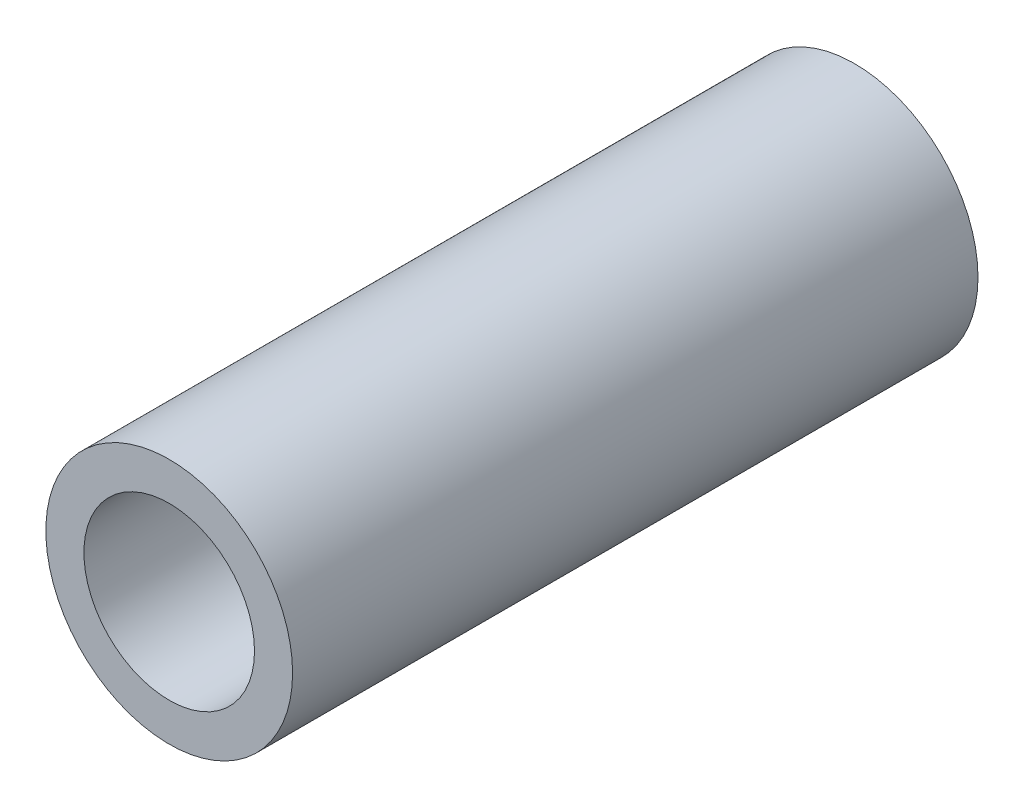
ISO-10303-21;
HEADER;
FILE_DESCRIPTION(('STEP AP214'),'2;1');
FILE_NAME('part.step','',(''),(''),'','','');
FILE_SCHEMA(('AUTOMOTIVE_DESIGN { 1 0 10303 214 1 1 1 1 }'));
ENDSEC;
DATA;
#1=APPLICATION_CONTEXT('core data for automotive mechanical design processes');
#2=APPLICATION_PROTOCOL_DEFINITION('international standard','automotive_design',2000,#1);
#3=PRODUCT_CONTEXT('',#1,'mechanical');
#4=PRODUCT('Part','Part','',(#3));
#5=PRODUCT_RELATED_PRODUCT_CATEGORY('part','',(#4));
#6=PRODUCT_DEFINITION_FORMATION('','',#4);
#7=PRODUCT_DEFINITION_CONTEXT('part definition',#1,'design');
#8=PRODUCT_DEFINITION('design','',#6,#7);
#9=PRODUCT_DEFINITION_SHAPE('','',#8);
#10=(LENGTH_UNIT() NAMED_UNIT(*) SI_UNIT(.MILLI.,.METRE.));
#11=(NAMED_UNIT(*) PLANE_ANGLE_UNIT() SI_UNIT($,.RADIAN.));
#12=(NAMED_UNIT(*) SI_UNIT($,.STERADIAN.) SOLID_ANGLE_UNIT());
#13=UNCERTAINTY_MEASURE_WITH_UNIT(LENGTH_MEASURE(1.E-05),#10,'distance_accuracy_value','');
#14=(GEOMETRIC_REPRESENTATION_CONTEXT(3) GLOBAL_UNCERTAINTY_ASSIGNED_CONTEXT((#13)) GLOBAL_UNIT_ASSIGNED_CONTEXT((#10,
#11,#12)) REPRESENTATION_CONTEXT('',''));
#15=CARTESIAN_POINT('',(0.,0.,0.));
#16=DIRECTION('',(0.,0.,1.));
#17=DIRECTION('',(1.,0.,0.));
#18=AXIS2_PLACEMENT_3D('',#15,#16,#17);
#19=CARTESIAN_POINT('',(-11.2187804531205,18.0595251742073,36.));
#20=DIRECTION('',(0.,0.,-1.));
#21=DIRECTION('',(-1.,0.,0.));
#22=AXIS2_PLACEMENT_3D('',#19,#20,#21);
#23=CYLINDRICAL_SURFACE('',#22,6.47985160828876);
#24=CARTESIAN_POINT('',(-11.2187804531205,18.0595251742073,36.));
#25=DIRECTION('',(0.,0.,1.));
#26=DIRECTION('',(1.,0.,0.));
#27=AXIS2_PLACEMENT_3D('',#24,#25,#26);
#28=CIRCLE('',#27,6.47985160828876);
#29=CARTESIAN_POINT('',(-4.73892884483178,18.0595251742073,36.));
#30=VERTEX_POINT('',#29);
#31=EDGE_CURVE('E10',#30,#30,#28,.T.);
#32=ORIENTED_EDGE('',*,*,#31,.F.);
#33=EDGE_LOOP('',(#32));
#34=FACE_BOUND('',#33,.T.);
#35=CARTESIAN_POINT('',(-11.2187804531205,18.0595251742073,0.));
#36=DIRECTION('',(0.,0.,1.));
#37=DIRECTION('',(1.,0.,0.));
#38=AXIS2_PLACEMENT_3D('',#35,#36,#37);
#39=CIRCLE('',#38,6.47985160828876);
#40=CARTESIAN_POINT('',(-4.73892884483178,18.0595251742073,0.));
#41=VERTEX_POINT('',#40);
#42=EDGE_CURVE('E44',#41,#41,#39,.T.);
#43=ORIENTED_EDGE('',*,*,#42,.T.);
#44=EDGE_LOOP('',(#43));
#45=FACE_BOUND('',#44,.T.);
#46=ADVANCED_FACE('F41',(#34,#45),#23,.T.);
#47=CARTESIAN_POINT('',(-11.2187804531205,18.0595251742073,36.));
#48=DIRECTION('',(0.,0.,1.));
#49=DIRECTION('',(1.,0.,0.));
#50=AXIS2_PLACEMENT_3D('',#47,#48,#49);
#51=PLANE('',#50);
#52=CARTESIAN_POINT('',(-11.2187804531205,18.0595251742073,36.));
#53=DIRECTION('',(0.,0.,1.));
#54=DIRECTION('',(1.,0.,0.));
#55=AXIS2_PLACEMENT_3D('',#52,#53,#54);
#56=CIRCLE('',#55,4.47985160828876);
#57=CARTESIAN_POINT('',(-6.73892884483178,18.0595251742073,36.));
#58=VERTEX_POINT('',#57);
#59=EDGE_CURVE('E58',#58,#58,#56,.T.);
#60=ORIENTED_EDGE('',*,*,#59,.F.);
#61=EDGE_LOOP('',(#60));
#62=FACE_BOUND('',#61,.T.);
#63=ORIENTED_EDGE('',*,*,#31,.T.);
#64=EDGE_LOOP('',(#63));
#65=FACE_BOUND('',#64,.T.);
#66=ADVANCED_FACE('F66',(#62,#65),#51,.T.);
#67=CARTESIAN_POINT('',(-11.2187804531205,18.0595251742073,0.));
#68=DIRECTION('',(0.,0.,1.));
#69=DIRECTION('',(1.,0.,0.));
#70=AXIS2_PLACEMENT_3D('',#67,#68,#69);
#71=PLANE('',#70);
#72=CARTESIAN_POINT('',(-11.2187804531205,18.0595251742073,0.));
#73=DIRECTION('',(0.,0.,1.));
#74=DIRECTION('',(1.,0.,0.));
#75=AXIS2_PLACEMENT_3D('',#72,#73,#74);
#76=CIRCLE('',#75,4.47985160828876);
#77=CARTESIAN_POINT('',(-6.73892884483178,18.0595251742073,0.));
#78=VERTEX_POINT('',#77);
#79=EDGE_CURVE('E53',#78,#78,#76,.F.);
#80=ORIENTED_EDGE('',*,*,#79,.F.);
#81=EDGE_LOOP('',(#80));
#82=FACE_BOUND('',#81,.T.);
#83=ORIENTED_EDGE('',*,*,#42,.F.);
#84=EDGE_LOOP('',(#83));
#85=FACE_BOUND('',#84,.T.);
#86=ADVANCED_FACE('F68',(#82,#85),#71,.F.);
#87=CARTESIAN_POINT('',(-11.2187804531205,18.0595251742073,-0.001000000000001));
#88=DIRECTION('',(0.,0.,1.));
#89=DIRECTION('',(1.,0.,0.));
#90=AXIS2_PLACEMENT_3D('',#87,#88,#89);
#91=CYLINDRICAL_SURFACE('',#90,4.47985160828876);
#92=ORIENTED_EDGE('',*,*,#59,.T.);
#93=EDGE_LOOP('',(#92));
#94=FACE_BOUND('',#93,.T.);
#95=ORIENTED_EDGE('',*,*,#79,.T.);
#96=EDGE_LOOP('',(#95));
#97=FACE_BOUND('',#96,.T.);
#98=ADVANCED_FACE('F63',(#94,#97),#91,.F.);
#99=CLOSED_SHELL('',(#46,#66,#86,#98));
#100=MANIFOLD_SOLID_BREP('B2',#99);
#101=ADVANCED_BREP_SHAPE_REPRESENTATION('',(#18,#100),#14);
#102=SHAPE_DEFINITION_REPRESENTATION(#9,#101);
ENDSEC;
END-ISO-10303-21;
